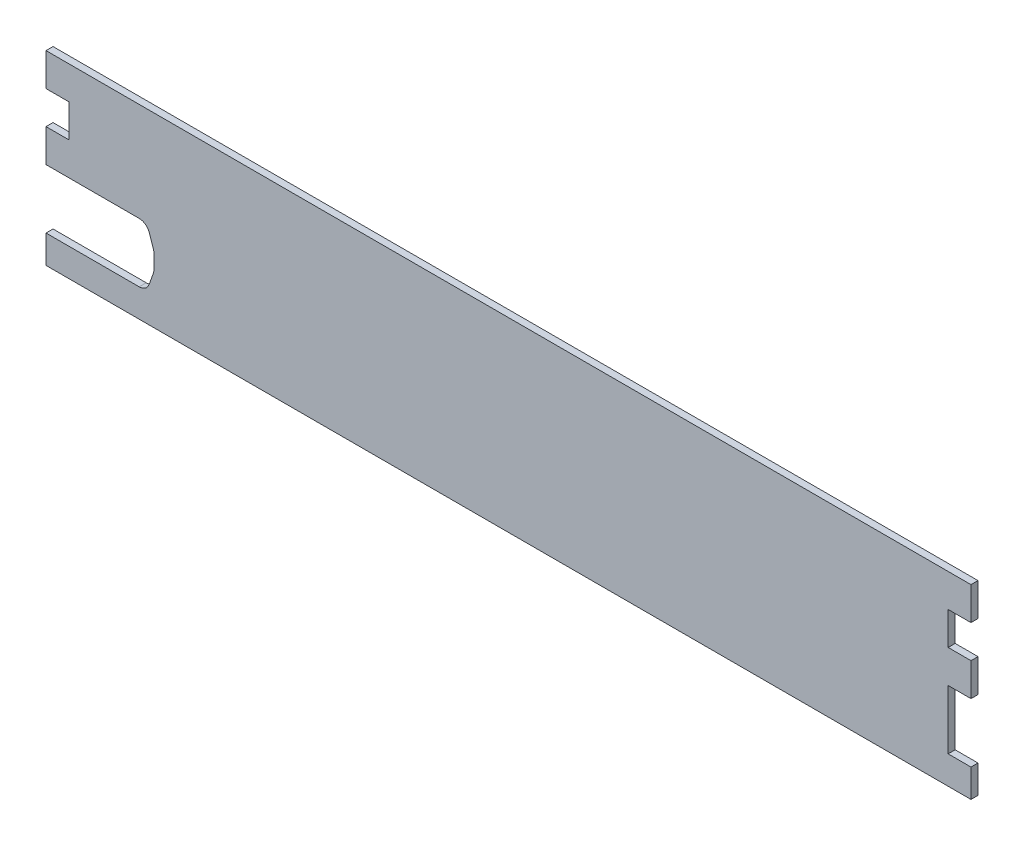
ISO-10303-21;
HEADER;
FILE_DESCRIPTION(('STEP AP214'),'2;1');
FILE_NAME('part.step','',(''),(''),'','','');
FILE_SCHEMA(('AUTOMOTIVE_DESIGN { 1 0 10303 214 1 1 1 1 }'));
ENDSEC;
DATA;
#1=APPLICATION_CONTEXT('core data for automotive mechanical design processes');
#2=APPLICATION_PROTOCOL_DEFINITION('international standard','automotive_design',2000,#1);
#3=PRODUCT_CONTEXT('',#1,'mechanical');
#4=PRODUCT('Part','Part','',(#3));
#5=PRODUCT_RELATED_PRODUCT_CATEGORY('part','',(#4));
#6=PRODUCT_DEFINITION_FORMATION('','',#4);
#7=PRODUCT_DEFINITION_CONTEXT('part definition',#1,'design');
#8=PRODUCT_DEFINITION('design','',#6,#7);
#9=PRODUCT_DEFINITION_SHAPE('','',#8);
#10=(LENGTH_UNIT() NAMED_UNIT(*) SI_UNIT(.MILLI.,.METRE.));
#11=(NAMED_UNIT(*) PLANE_ANGLE_UNIT() SI_UNIT($,.RADIAN.));
#12=(NAMED_UNIT(*) SI_UNIT($,.STERADIAN.) SOLID_ANGLE_UNIT());
#13=UNCERTAINTY_MEASURE_WITH_UNIT(LENGTH_MEASURE(1.E-05),#10,'distance_accuracy_value','');
#14=(GEOMETRIC_REPRESENTATION_CONTEXT(3) GLOBAL_UNCERTAINTY_ASSIGNED_CONTEXT((#13)) GLOBAL_UNIT_ASSIGNED_CONTEXT((#10,
#11,#12)) REPRESENTATION_CONTEXT('',''));
#15=CARTESIAN_POINT('',(0.,0.,0.));
#16=DIRECTION('',(0.,0.,1.));
#17=DIRECTION('',(1.,0.,0.));
#18=AXIS2_PLACEMENT_3D('',#15,#16,#17);
#19=CARTESIAN_POINT('',(-617.248326024445,-67.185778963985,-2.));
#20=DIRECTION('',(-8.04911692853256E-13,1.,0.));
#21=DIRECTION('',(-1.,-8.04911692853256E-13,0.));
#22=AXIS2_PLACEMENT_3D('',#19,#20,#21);
#23=PLANE('',#22);
#24=DIRECTION('',(-1.,-8.04911692853256E-13,0.));
#25=VECTOR('',#24,1.);
#26=CARTESIAN_POINT('',(-617.248326024445,-67.185778963985,0.));
#27=LINE('',#26,#25);
#28=CARTESIAN_POINT('',(-614.748326024445,-67.185778963983,0.));
#29=VERTEX_POINT('',#28);
#30=CARTESIAN_POINT('',(-621.248326024445,-67.185778963985,0.));
#31=VERTEX_POINT('',#30);
#32=EDGE_CURVE('E311',#29,#31,#27,.T.);
#33=ORIENTED_EDGE('',*,*,#32,.F.);
#34=DIRECTION('',(0.,0.,1.));
#35=VECTOR('',#34,1.);
#36=CARTESIAN_POINT('',(-614.748326024445,-67.185778963983,-2.));
#37=LINE('',#36,#35);
#38=CARTESIAN_POINT('',(-614.748326024445,-67.185778963983,-2.));
#39=VERTEX_POINT('',#38);
#40=EDGE_CURVE('E11',#39,#29,#37,.T.);
#41=ORIENTED_EDGE('',*,*,#40,.F.);
#42=DIRECTION('',(-1.,0.,0.));
#43=VECTOR('',#42,1.);
#44=CARTESIAN_POINT('',(-617.248326024445,-67.185778963985,-2.));
#45=LINE('',#44,#43);
#46=CARTESIAN_POINT('',(-621.248326024445,-67.185778963985,-2.));
#47=VERTEX_POINT('',#46);
#48=EDGE_CURVE('E52',#39,#47,#45,.T.);
#49=ORIENTED_EDGE('',*,*,#48,.T.);
#50=DIRECTION('',(0.,0.,1.));
#51=VECTOR('',#50,1.);
#52=CARTESIAN_POINT('',(-621.248326024445,-67.185778963985,-2.));
#53=LINE('',#52,#51);
#54=EDGE_CURVE('E37',#47,#31,#53,.T.);
#55=ORIENTED_EDGE('',*,*,#54,.T.);
#56=EDGE_LOOP('',(#33,#41,#49,#55));
#57=FACE_BOUND('',#56,.T.);
#58=ADVANCED_FACE('F33',(#57),#23,.T.);
#59=CARTESIAN_POINT('',(-614.748326024445,-75.1857789638208,-2.));
#60=DIRECTION('',(1.,0.,0.));
#61=DIRECTION('',(0.,0.,-1.));
#62=AXIS2_PLACEMENT_3D('',#59,#60,#61);
#63=PLANE('',#62);
#64=DIRECTION('',(0.,1.,0.));
#65=VECTOR('',#64,1.);
#66=CARTESIAN_POINT('',(-614.748326024445,-75.1857789638208,0.));
#67=LINE('',#66,#65);
#68=CARTESIAN_POINT('',(-614.748326024445,-75.1857789638208,0.));
#69=VERTEX_POINT('',#68);
#70=EDGE_CURVE('E309',#69,#29,#67,.T.);
#71=ORIENTED_EDGE('',*,*,#70,.F.);
#72=DIRECTION('',(0.,0.,1.));
#73=VECTOR('',#72,1.);
#74=CARTESIAN_POINT('',(-614.748326024445,-75.1857789638208,-2.));
#75=LINE('',#74,#73);
#76=CARTESIAN_POINT('',(-614.748326024445,-75.1857789638208,-2.));
#77=VERTEX_POINT('',#76);
#78=EDGE_CURVE('E43',#77,#69,#75,.T.);
#79=ORIENTED_EDGE('',*,*,#78,.F.);
#80=DIRECTION('',(0.,1.,0.));
#81=VECTOR('',#80,1.);
#82=CARTESIAN_POINT('',(-614.748326024445,-75.1857789638208,-2.));
#83=LINE('',#82,#81);
#84=EDGE_CURVE('E229',#77,#39,#83,.T.);
#85=ORIENTED_EDGE('',*,*,#84,.T.);
#86=ORIENTED_EDGE('',*,*,#40,.T.);
#87=EDGE_LOOP('',(#71,#79,#85,#86));
#88=FACE_BOUND('',#87,.T.);
#89=ADVANCED_FACE('F367',(#88),#63,.T.);
#90=CARTESIAN_POINT('',(-617.248326024445,-75.1857789638208,-2.));
#91=DIRECTION('',(0.,-1.,0.));
#92=DIRECTION('',(0.,0.,-1.));
#93=AXIS2_PLACEMENT_3D('',#90,#91,#92);
#94=PLANE('',#93);
#95=DIRECTION('',(1.,0.,0.));
#96=VECTOR('',#95,1.);
#97=CARTESIAN_POINT('',(-617.248326024445,-75.1857789638208,0.));
#98=LINE('',#97,#96);
#99=CARTESIAN_POINT('',(-878.248326024445,-75.1857789638218,0.));
#100=VERTEX_POINT('',#99);
#101=EDGE_CURVE('E218',#100,#69,#98,.T.);
#102=ORIENTED_EDGE('',*,*,#101,.F.);
#103=DIRECTION('',(0.,0.,1.));
#104=VECTOR('',#103,1.);
#105=CARTESIAN_POINT('',(-878.248326024445,-75.1857789638218,-2.));
#106=LINE('',#105,#104);
#107=CARTESIAN_POINT('',(-878.248326024445,-75.1857789638218,-2.));
#108=VERTEX_POINT('',#107);
#109=EDGE_CURVE('E213',#108,#100,#106,.T.);
#110=ORIENTED_EDGE('',*,*,#109,.F.);
#111=DIRECTION('',(1.,0.,0.));
#112=VECTOR('',#111,1.);
#113=CARTESIAN_POINT('',(-875.748326024445,-75.1857789638218,-2.));
#114=LINE('',#113,#112);
#115=EDGE_CURVE('E216',#108,#77,#114,.T.);
#116=ORIENTED_EDGE('',*,*,#115,.T.);
#117=ORIENTED_EDGE('',*,*,#78,.T.);
#118=EDGE_LOOP('',(#102,#110,#116,#117));
#119=FACE_BOUND('',#118,.T.);
#120=ADVANCED_FACE('F215',(#119),#94,.T.);
#121=CARTESIAN_POINT('',(-878.248326024445,-75.1857789638218,-2.));
#122=DIRECTION('',(-1.,0.,0.));
#123=DIRECTION('',(0.,0.,1.));
#124=AXIS2_PLACEMENT_3D('',#121,#122,#123);
#125=PLANE('',#124);
#126=DIRECTION('',(0.,-1.,0.));
#127=VECTOR('',#126,1.);
#128=CARTESIAN_POINT('',(-878.248326024445,-75.1857789638218,0.));
#129=LINE('',#128,#127);
#130=CARTESIAN_POINT('',(-878.248326024445,-67.185778963983,0.));
#131=VERTEX_POINT('',#130);
#132=EDGE_CURVE('E306',#131,#100,#129,.T.);
#133=ORIENTED_EDGE('',*,*,#132,.F.);
#134=DIRECTION('',(0.,0.,1.));
#135=VECTOR('',#134,1.);
#136=CARTESIAN_POINT('',(-878.248326024445,-67.185778963983,-2.));
#137=LINE('',#136,#135);
#138=CARTESIAN_POINT('',(-878.248326024445,-67.185778963983,-2.));
#139=VERTEX_POINT('',#138);
#140=EDGE_CURVE('E223',#139,#131,#137,.T.);
#141=ORIENTED_EDGE('',*,*,#140,.F.);
#142=DIRECTION('',(0.,-1.,0.));
#143=VECTOR('',#142,1.);
#144=CARTESIAN_POINT('',(-878.248326024445,-75.1857789638218,-2.));
#145=LINE('',#144,#143);
#146=EDGE_CURVE('E228',#139,#108,#145,.T.);
#147=ORIENTED_EDGE('',*,*,#146,.T.);
#148=ORIENTED_EDGE('',*,*,#109,.T.);
#149=EDGE_LOOP('',(#133,#141,#147,#148));
#150=FACE_BOUND('',#149,.T.);
#151=ADVANCED_FACE('F232',(#150),#125,.T.);
#152=CARTESIAN_POINT('',(-875.748326024445,-67.185778963983,-2.));
#153=DIRECTION('',(0.,1.,0.));
#154=DIRECTION('',(0.,0.,1.));
#155=AXIS2_PLACEMENT_3D('',#152,#153,#154);
#156=PLANE('',#155);
#157=DIRECTION('',(-1.,0.,0.));
#158=VECTOR('',#157,1.);
#159=CARTESIAN_POINT('',(-875.748326024445,-67.185778963983,0.));
#160=LINE('',#159,#158);
#161=CARTESIAN_POINT('',(-851.698326024445,-67.1857789639835,0.));
#162=VERTEX_POINT('',#161);
#163=EDGE_CURVE('E303',#162,#131,#160,.T.);
#164=ORIENTED_EDGE('',*,*,#163,.F.);
#165=DIRECTION('',(0.,0.,1.));
#166=VECTOR('',#165,1.);
#167=CARTESIAN_POINT('',(-851.698326024445,-67.1857789639835,-2.));
#168=LINE('',#167,#166);
#169=CARTESIAN_POINT('',(-851.698326024445,-67.1857789639835,-2.));
#170=VERTEX_POINT('',#169);
#171=EDGE_CURVE('E315',#170,#162,#168,.T.);
#172=ORIENTED_EDGE('',*,*,#171,.F.);
#173=DIRECTION('',(-1.,0.,0.));
#174=VECTOR('',#173,1.);
#175=CARTESIAN_POINT('',(-851.698326024445,-67.1857789639835,-2.));
#176=LINE('',#175,#174);
#177=EDGE_CURVE('E233',#170,#139,#176,.T.);
#178=ORIENTED_EDGE('',*,*,#177,.T.);
#179=ORIENTED_EDGE('',*,*,#140,.T.);
#180=EDGE_LOOP('',(#164,#172,#178,#179));
#181=FACE_BOUND('',#180,.T.);
#182=ADVANCED_FACE('F380',(#181),#156,.T.);
#183=CARTESIAN_POINT('',(-851.698326024445,-64.185778963983,-2.));
#184=DIRECTION('',(0.,0.,1.));
#185=DIRECTION('',(1.,0.,0.));
#186=AXIS2_PLACEMENT_3D('',#183,#184,#185);
#187=CYLINDRICAL_SURFACE('',#186,3.00000000000059);
#188=CARTESIAN_POINT('',(-851.698326024445,-64.185778963983,0.));
#189=DIRECTION('',(0.,0.,-1.));
#190=DIRECTION('',(1.,0.,0.));
#191=AXIS2_PLACEMENT_3D('',#188,#189,#190);
#192=CIRCLE('',#191,3.00000000000059);
#193=CARTESIAN_POINT('',(-848.873290675921,-65.1953210778113,0.));
#194=VERTEX_POINT('',#193);
#195=EDGE_CURVE('E300',#194,#162,#192,.T.);
#196=ORIENTED_EDGE('',*,*,#195,.F.);
#197=DIRECTION('',(0.,0.,1.));
#198=VECTOR('',#197,1.);
#199=CARTESIAN_POINT('',(-848.873290675921,-65.1953210778113,-2.));
#200=LINE('',#199,#198);
#201=CARTESIAN_POINT('',(-848.873290675921,-65.1953210778113,-2.));
#202=VERTEX_POINT('',#201);
#203=EDGE_CURVE('E318',#202,#194,#200,.T.);
#204=ORIENTED_EDGE('',*,*,#203,.F.);
#205=CARTESIAN_POINT('',(-851.698326024445,-64.185778963983,-2.));
#206=DIRECTION('',(0.,0.,-1.));
#207=DIRECTION('',(1.,0.,0.));
#208=AXIS2_PLACEMENT_3D('',#205,#206,#207);
#209=CIRCLE('',#208,3.00000000000059);
#210=EDGE_CURVE('E235',#202,#170,#209,.T.);
#211=ORIENTED_EDGE('',*,*,#210,.T.);
#212=ORIENTED_EDGE('',*,*,#171,.T.);
#213=EDGE_LOOP('',(#196,#204,#211,#212));
#214=FACE_BOUND('',#213,.T.);
#215=ADVANCED_FACE('F383',(#214),#187,.F.);
#216=CARTESIAN_POINT('',(-847.673290675921,-61.8373210778111,-2.));
#217=DIRECTION('',(-0.941678449508098,0.336514037941991,0.));
#218=DIRECTION('',(-0.336514037941991,-0.941678449508099,0.));
#219=AXIS2_PLACEMENT_3D('',#216,#217,#218);
#220=PLANE('',#219);
#221=DIRECTION('',(-0.336514037941991,-0.941678449508098,0.));
#222=VECTOR('',#221,1.);
#223=CARTESIAN_POINT('',(-847.673290675921,-61.8373210778111,0.));
#224=LINE('',#223,#222);
#225=CARTESIAN_POINT('',(-847.673290675921,-61.8373210778111,0.));
#226=VERTEX_POINT('',#225);
#227=EDGE_CURVE('E297',#226,#194,#224,.T.);
#228=ORIENTED_EDGE('',*,*,#227,.F.);
#229=DIRECTION('',(0.,0.,1.));
#230=VECTOR('',#229,1.);
#231=CARTESIAN_POINT('',(-847.673290675921,-61.8373210778111,-2.));
#232=LINE('',#231,#230);
#233=CARTESIAN_POINT('',(-847.673290675921,-61.8373210778111,-2.));
#234=VERTEX_POINT('',#233);
#235=EDGE_CURVE('E320',#234,#226,#232,.T.);
#236=ORIENTED_EDGE('',*,*,#235,.F.);
#237=DIRECTION('',(-0.336514037941991,-0.941678449508098,0.));
#238=VECTOR('',#237,1.);
#239=CARTESIAN_POINT('',(-847.673290675921,-61.8373210778111,-2.));
#240=LINE('',#239,#238);
#241=EDGE_CURVE('E522',#234,#202,#240,.T.);
#242=ORIENTED_EDGE('',*,*,#241,.T.);
#243=ORIENTED_EDGE('',*,*,#203,.T.);
#244=EDGE_LOOP('',(#228,#236,#242,#243));
#245=FACE_BOUND('',#244,.T.);
#246=ADVANCED_FACE('F387',(#245),#220,.T.);
#247=CARTESIAN_POINT('',(-850.498326024445,-60.827778963983,-2.));
#248=DIRECTION('',(0.,0.,1.));
#249=DIRECTION('',(1.,0.,0.));
#250=AXIS2_PLACEMENT_3D('',#247,#248,#249);
#251=CYLINDRICAL_SURFACE('',#250,3.00000000000021);
#252=CARTESIAN_POINT('',(-850.498326024445,-60.827778963983,0.));
#253=DIRECTION('',(0.,0.,-1.));
#254=DIRECTION('',(1.,0.,0.));
#255=AXIS2_PLACEMENT_3D('',#252,#253,#254);
#256=CIRCLE('',#255,3.00000000000021);
#257=CARTESIAN_POINT('',(-847.498326024445,-60.827778963983,0.));
#258=VERTEX_POINT('',#257);
#259=EDGE_CURVE('E294',#258,#226,#256,.T.);
#260=ORIENTED_EDGE('',*,*,#259,.F.);
#261=DIRECTION('',(0.,0.,1.));
#262=VECTOR('',#261,1.);
#263=CARTESIAN_POINT('',(-847.498326024445,-60.827778963983,-2.));
#264=LINE('',#263,#262);
#265=CARTESIAN_POINT('',(-847.498326024445,-60.827778963983,-2.));
#266=VERTEX_POINT('',#265);
#267=EDGE_CURVE('E322',#266,#258,#264,.T.);
#268=ORIENTED_EDGE('',*,*,#267,.F.);
#269=CARTESIAN_POINT('',(-850.498326024445,-60.827778963983,-2.));
#270=DIRECTION('',(0.,0.,-1.));
#271=DIRECTION('',(1.,0.,0.));
#272=AXIS2_PLACEMENT_3D('',#269,#270,#271);
#273=CIRCLE('',#272,3.00000000000021);
#274=EDGE_CURVE('E519',#266,#234,#273,.T.);
#275=ORIENTED_EDGE('',*,*,#274,.T.);
#276=ORIENTED_EDGE('',*,*,#235,.T.);
#277=EDGE_LOOP('',(#260,#268,#275,#276));
#278=FACE_BOUND('',#277,.T.);
#279=ADVANCED_FACE('F391',(#278),#251,.F.);
#280=CARTESIAN_POINT('',(-847.498326024445,-56.827778963983,-2.));
#281=DIRECTION('',(-1.,-1.38777878078144E-13,0.));
#282=DIRECTION('',(1.38777878078144E-13,-1.,0.));
#283=AXIS2_PLACEMENT_3D('',#280,#281,#282);
#284=PLANE('',#283);
#285=DIRECTION('',(1.38777878078144E-13,-1.,0.));
#286=VECTOR('',#285,1.);
#287=CARTESIAN_POINT('',(-847.498326024445,-56.827778963983,0.));
#288=LINE('',#287,#286);
#289=CARTESIAN_POINT('',(-847.498326024445,-56.827778963983,0.));
#290=VERTEX_POINT('',#289);
#291=EDGE_CURVE('E291',#290,#258,#288,.T.);
#292=ORIENTED_EDGE('',*,*,#291,.F.);
#293=DIRECTION('',(0.,0.,1.));
#294=VECTOR('',#293,1.);
#295=CARTESIAN_POINT('',(-847.498326024445,-56.827778963983,-2.));
#296=LINE('',#295,#294);
#297=CARTESIAN_POINT('',(-847.498326024445,-56.827778963983,-2.));
#298=VERTEX_POINT('',#297);
#299=EDGE_CURVE('E324',#298,#290,#296,.T.);
#300=ORIENTED_EDGE('',*,*,#299,.F.);
#301=DIRECTION('',(1.38777878078144E-13,-1.,0.));
#302=VECTOR('',#301,1.);
#303=CARTESIAN_POINT('',(-847.498326024445,-56.827778963983,-2.));
#304=LINE('',#303,#302);
#305=EDGE_CURVE('E516',#298,#266,#304,.T.);
#306=ORIENTED_EDGE('',*,*,#305,.T.);
#307=ORIENTED_EDGE('',*,*,#267,.T.);
#308=EDGE_LOOP('',(#292,#300,#306,#307));
#309=FACE_BOUND('',#308,.T.);
#310=ADVANCED_FACE('F395',(#309),#284,.T.);
#311=CARTESIAN_POINT('',(-850.498326024445,-56.827778963983,-2.));
#312=DIRECTION('',(0.,0.,1.));
#313=DIRECTION('',(1.,0.,0.));
#314=AXIS2_PLACEMENT_3D('',#311,#312,#313);
#315=CYLINDRICAL_SURFACE('',#314,2.99999999999946);
#316=CARTESIAN_POINT('',(-850.498326024445,-56.827778963983,0.));
#317=DIRECTION('',(0.,0.,-1.));
#318=DIRECTION('',(1.,0.,0.));
#319=AXIS2_PLACEMENT_3D('',#316,#317,#318);
#320=CIRCLE('',#319,2.99999999999946);
#321=CARTESIAN_POINT('',(-847.659216216776,-55.8585238376117,0.));
#322=VERTEX_POINT('',#321);
#323=EDGE_CURVE('E288',#322,#290,#320,.T.);
#324=ORIENTED_EDGE('',*,*,#323,.F.);
#325=DIRECTION('',(0.,0.,1.));
#326=VECTOR('',#325,1.);
#327=CARTESIAN_POINT('',(-847.659216216776,-55.8585238376117,-2.));
#328=LINE('',#327,#326);
#329=CARTESIAN_POINT('',(-847.659216216776,-55.8585238376117,-2.));
#330=VERTEX_POINT('',#329);
#331=EDGE_CURVE('E326',#330,#322,#328,.T.);
#332=ORIENTED_EDGE('',*,*,#331,.F.);
#333=CARTESIAN_POINT('',(-850.498326024445,-56.827778963983,-2.));
#334=DIRECTION('',(0.,0.,-1.));
#335=DIRECTION('',(1.,0.,0.));
#336=AXIS2_PLACEMENT_3D('',#333,#334,#335);
#337=CIRCLE('',#336,2.99999999999946);
#338=EDGE_CURVE('E513',#330,#298,#337,.T.);
#339=ORIENTED_EDGE('',*,*,#338,.T.);
#340=ORIENTED_EDGE('',*,*,#299,.T.);
#341=EDGE_LOOP('',(#324,#332,#339,#340));
#342=FACE_BOUND('',#341,.T.);
#343=ADVANCED_FACE('F399',(#342),#315,.F.);
#344=CARTESIAN_POINT('',(-848.859216216776,-52.3435238376116,-2.));
#345=DIRECTION('',(-0.946369935889529,-0.32308504212428,0.));
#346=DIRECTION('',(0.32308504212428,-0.946369935889529,0.));
#347=AXIS2_PLACEMENT_3D('',#344,#345,#346);
#348=PLANE('',#347);
#349=DIRECTION('',(0.32308504212428,-0.946369935889529,0.));
#350=VECTOR('',#349,1.);
#351=CARTESIAN_POINT('',(-848.859216216776,-52.3435238376116,0.));
#352=LINE('',#351,#350);
#353=CARTESIAN_POINT('',(-848.859216216776,-52.3435238376116,0.));
#354=VERTEX_POINT('',#353);
#355=EDGE_CURVE('E285',#354,#322,#352,.T.);
#356=ORIENTED_EDGE('',*,*,#355,.F.);
#357=DIRECTION('',(0.,0.,1.));
#358=VECTOR('',#357,1.);
#359=CARTESIAN_POINT('',(-848.859216216776,-52.3435238376116,-2.));
#360=LINE('',#359,#358);
#361=CARTESIAN_POINT('',(-848.859216216776,-52.3435238376116,-2.));
#362=VERTEX_POINT('',#361);
#363=EDGE_CURVE('E328',#362,#354,#360,.T.);
#364=ORIENTED_EDGE('',*,*,#363,.F.);
#365=DIRECTION('',(0.32308504212428,-0.946369935889529,0.));
#366=VECTOR('',#365,1.);
#367=CARTESIAN_POINT('',(-848.859216216776,-52.3435238376116,-2.));
#368=LINE('',#367,#366);
#369=EDGE_CURVE('E510',#362,#330,#368,.T.);
#370=ORIENTED_EDGE('',*,*,#369,.T.);
#371=ORIENTED_EDGE('',*,*,#331,.T.);
#372=EDGE_LOOP('',(#356,#364,#370,#371));
#373=FACE_BOUND('',#372,.T.);
#374=ADVANCED_FACE('F403',(#373),#348,.T.);
#375=CARTESIAN_POINT('',(-851.698326024445,-53.312778963983,-2.));
#376=DIRECTION('',(0.,0.,1.));
#377=DIRECTION('',(1.,0.,0.));
#378=AXIS2_PLACEMENT_3D('',#375,#376,#377);
#379=CYLINDRICAL_SURFACE('',#378,2.99999999999992);
#380=CARTESIAN_POINT('',(-851.698326024445,-53.312778963983,0.));
#381=DIRECTION('',(0.,0.,-1.));
#382=DIRECTION('',(1.,0.,0.));
#383=AXIS2_PLACEMENT_3D('',#380,#381,#382);
#384=CIRCLE('',#383,2.99999999999992);
#385=CARTESIAN_POINT('',(-851.698326024445,-50.3127789639831,0.));
#386=VERTEX_POINT('',#385);
#387=EDGE_CURVE('E282',#386,#354,#384,.T.);
#388=ORIENTED_EDGE('',*,*,#387,.F.);
#389=DIRECTION('',(0.,0.,1.));
#390=VECTOR('',#389,1.);
#391=CARTESIAN_POINT('',(-851.698326024445,-50.3127789639831,-2.));
#392=LINE('',#391,#390);
#393=CARTESIAN_POINT('',(-851.698326024445,-50.3127789639831,-2.));
#394=VERTEX_POINT('',#393);
#395=EDGE_CURVE('E330',#394,#386,#392,.T.);
#396=ORIENTED_EDGE('',*,*,#395,.F.);
#397=CARTESIAN_POINT('',(-851.698326024445,-53.312778963983,-2.));
#398=DIRECTION('',(0.,0.,-1.));
#399=DIRECTION('',(1.,0.,0.));
#400=AXIS2_PLACEMENT_3D('',#397,#398,#399);
#401=CIRCLE('',#400,2.99999999999992);
#402=EDGE_CURVE('E507',#394,#362,#401,.T.);
#403=ORIENTED_EDGE('',*,*,#402,.T.);
#404=ORIENTED_EDGE('',*,*,#363,.T.);
#405=EDGE_LOOP('',(#388,#396,#403,#404));
#406=FACE_BOUND('',#405,.T.);
#407=ADVANCED_FACE('F407',(#406),#379,.F.);
#408=CARTESIAN_POINT('',(-875.748326024445,-50.312778963983,-2.));
#409=DIRECTION('',(0.,-1.,0.));
#410=DIRECTION('',(1.,0.,0.));
#411=AXIS2_PLACEMENT_3D('',#408,#409,#410);
#412=PLANE('',#411);
#413=DIRECTION('',(1.,0.,0.));
#414=VECTOR('',#413,1.);
#415=CARTESIAN_POINT('',(-875.748326024445,-50.312778963983,0.));
#416=LINE('',#415,#414);
#417=CARTESIAN_POINT('',(-878.248326024445,-50.312778963983,0.));
#418=VERTEX_POINT('',#417);
#419=EDGE_CURVE('E279',#418,#386,#416,.T.);
#420=ORIENTED_EDGE('',*,*,#419,.F.);
#421=DIRECTION('',(0.,0.,1.));
#422=VECTOR('',#421,1.);
#423=CARTESIAN_POINT('',(-878.248326024445,-50.312778963983,-2.));
#424=LINE('',#423,#422);
#425=CARTESIAN_POINT('',(-878.248326024445,-50.312778963983,-2.));
#426=VERTEX_POINT('',#425);
#427=EDGE_CURVE('E332',#426,#418,#424,.T.);
#428=ORIENTED_EDGE('',*,*,#427,.F.);
#429=DIRECTION('',(1.,0.,0.));
#430=VECTOR('',#429,1.);
#431=CARTESIAN_POINT('',(-875.748326024445,-50.312778963983,-2.));
#432=LINE('',#431,#430);
#433=EDGE_CURVE('E505',#426,#394,#432,.T.);
#434=ORIENTED_EDGE('',*,*,#433,.T.);
#435=ORIENTED_EDGE('',*,*,#395,.T.);
#436=EDGE_LOOP('',(#420,#428,#434,#435));
#437=FACE_BOUND('',#436,.T.);
#438=ADVANCED_FACE('F411',(#437),#412,.T.);
#439=CARTESIAN_POINT('',(-878.248326024445,-50.312778963983,-2.));
#440=DIRECTION('',(-1.,0.,0.));
#441=DIRECTION('',(0.,0.,1.));
#442=AXIS2_PLACEMENT_3D('',#439,#440,#441);
#443=PLANE('',#442);
#444=DIRECTION('',(0.,-1.,0.));
#445=VECTOR('',#444,1.);
#446=CARTESIAN_POINT('',(-878.248326024445,-50.312778963983,0.));
#447=LINE('',#446,#445);
#448=CARTESIAN_POINT('',(-878.248326024445,-40.9356516944667,0.));
#449=VERTEX_POINT('',#448);
#450=EDGE_CURVE('E276',#449,#418,#447,.T.);
#451=ORIENTED_EDGE('',*,*,#450,.F.);
#452=DIRECTION('',(0.,0.,1.));
#453=VECTOR('',#452,1.);
#454=CARTESIAN_POINT('',(-878.248326024445,-40.9356516944667,-2.));
#455=LINE('',#454,#453);
#456=CARTESIAN_POINT('',(-878.248326024445,-40.9356516944667,-2.));
#457=VERTEX_POINT('',#456);
#458=EDGE_CURVE('E335',#457,#449,#455,.T.);
#459=ORIENTED_EDGE('',*,*,#458,.F.);
#460=DIRECTION('',(0.,-1.,0.));
#461=VECTOR('',#460,1.);
#462=CARTESIAN_POINT('',(-878.248326024445,-50.312778963983,-2.));
#463=LINE('',#462,#461);
#464=EDGE_CURVE('E502',#457,#426,#463,.T.);
#465=ORIENTED_EDGE('',*,*,#464,.T.);
#466=ORIENTED_EDGE('',*,*,#427,.T.);
#467=EDGE_LOOP('',(#451,#459,#465,#466));
#468=FACE_BOUND('',#467,.T.);
#469=ADVANCED_FACE('F415',(#468),#443,.T.);
#470=CARTESIAN_POINT('',(-875.748326024445,-40.9356516944667,-2.));
#471=DIRECTION('',(0.,1.,0.));
#472=DIRECTION('',(-1.,0.,0.));
#473=AXIS2_PLACEMENT_3D('',#470,#471,#472);
#474=PLANE('',#473);
#475=DIRECTION('',(-1.,0.,0.));
#476=VECTOR('',#475,1.);
#477=CARTESIAN_POINT('',(-875.748326024445,-40.9356516944667,0.));
#478=LINE('',#477,#476);
#479=CARTESIAN_POINT('',(-871.748326024445,-40.9356516944667,0.));
#480=VERTEX_POINT('',#479);
#481=EDGE_CURVE('E273',#480,#449,#478,.T.);
#482=ORIENTED_EDGE('',*,*,#481,.F.);
#483=DIRECTION('',(0.,0.,1.));
#484=VECTOR('',#483,1.);
#485=CARTESIAN_POINT('',(-871.748326024445,-40.9356516944667,-2.));
#486=LINE('',#485,#484);
#487=CARTESIAN_POINT('',(-871.748326024445,-40.9356516944667,-2.));
#488=VERTEX_POINT('',#487);
#489=EDGE_CURVE('E337',#488,#480,#486,.T.);
#490=ORIENTED_EDGE('',*,*,#489,.F.);
#491=DIRECTION('',(-1.,0.,0.));
#492=VECTOR('',#491,1.);
#493=CARTESIAN_POINT('',(-871.748326024445,-40.9356516944667,-2.));
#494=LINE('',#493,#492);
#495=EDGE_CURVE('E500',#488,#457,#494,.T.);
#496=ORIENTED_EDGE('',*,*,#495,.T.);
#497=ORIENTED_EDGE('',*,*,#458,.T.);
#498=EDGE_LOOP('',(#482,#490,#496,#497));
#499=FACE_BOUND('',#498,.T.);
#500=ADVANCED_FACE('F419',(#499),#474,.T.);
#501=CARTESIAN_POINT('',(-871.748326024445,-31.5585244249505,-2.));
#502=DIRECTION('',(-1.,0.,0.));
#503=DIRECTION('',(0.,0.,1.));
#504=AXIS2_PLACEMENT_3D('',#501,#502,#503);
#505=PLANE('',#504);
#506=DIRECTION('',(0.,-1.,0.));
#507=VECTOR('',#506,1.);
#508=CARTESIAN_POINT('',(-871.748326024445,-31.5585244249505,0.));
#509=LINE('',#508,#507);
#510=CARTESIAN_POINT('',(-871.748326024445,-31.5585244249505,0.));
#511=VERTEX_POINT('',#510);
#512=EDGE_CURVE('E270',#511,#480,#509,.T.);
#513=ORIENTED_EDGE('',*,*,#512,.F.);
#514=DIRECTION('',(0.,0.,1.));
#515=VECTOR('',#514,1.);
#516=CARTESIAN_POINT('',(-871.748326024445,-31.5585244249505,-2.));
#517=LINE('',#516,#515);
#518=CARTESIAN_POINT('',(-871.748326024445,-31.5585244249505,-2.));
#519=VERTEX_POINT('',#518);
#520=EDGE_CURVE('E340',#519,#511,#517,.T.);
#521=ORIENTED_EDGE('',*,*,#520,.F.);
#522=DIRECTION('',(0.,-1.,0.));
#523=VECTOR('',#522,1.);
#524=CARTESIAN_POINT('',(-871.748326024445,-31.5585244249505,-2.));
#525=LINE('',#524,#523);
#526=EDGE_CURVE('E497',#519,#488,#525,.T.);
#527=ORIENTED_EDGE('',*,*,#526,.T.);
#528=ORIENTED_EDGE('',*,*,#489,.T.);
#529=EDGE_LOOP('',(#513,#521,#527,#528));
#530=FACE_BOUND('',#529,.T.);
#531=ADVANCED_FACE('F423',(#530),#505,.T.);
#532=CARTESIAN_POINT('',(-875.748326024445,-31.5585244249505,-2.));
#533=DIRECTION('',(0.,-1.,0.));
#534=DIRECTION('',(0.,0.,-1.));
#535=AXIS2_PLACEMENT_3D('',#532,#533,#534);
#536=PLANE('',#535);
#537=DIRECTION('',(1.,0.,0.));
#538=VECTOR('',#537,1.);
#539=CARTESIAN_POINT('',(-875.748326024445,-31.5585244249505,0.));
#540=LINE('',#539,#538);
#541=CARTESIAN_POINT('',(-878.248326024445,-31.5585244249505,0.));
#542=VERTEX_POINT('',#541);
#543=EDGE_CURVE('E267',#542,#511,#540,.T.);
#544=ORIENTED_EDGE('',*,*,#543,.F.);
#545=DIRECTION('',(0.,0.,1.));
#546=VECTOR('',#545,1.);
#547=CARTESIAN_POINT('',(-878.248326024445,-31.5585244249505,-2.));
#548=LINE('',#547,#546);
#549=CARTESIAN_POINT('',(-878.248326024445,-31.5585244249505,-2.));
#550=VERTEX_POINT('',#549);
#551=EDGE_CURVE('E342',#550,#542,#548,.T.);
#552=ORIENTED_EDGE('',*,*,#551,.F.);
#553=DIRECTION('',(1.,0.,0.));
#554=VECTOR('',#553,1.);
#555=CARTESIAN_POINT('',(-875.748326024445,-31.5585244249505,-2.));
#556=LINE('',#555,#554);
#557=EDGE_CURVE('E495',#550,#519,#556,.T.);
#558=ORIENTED_EDGE('',*,*,#557,.T.);
#559=ORIENTED_EDGE('',*,*,#520,.T.);
#560=EDGE_LOOP('',(#544,#552,#558,#559));
#561=FACE_BOUND('',#560,.T.);
#562=ADVANCED_FACE('F427',(#561),#536,.T.);
#563=CARTESIAN_POINT('',(-878.248326024445,-31.5585244249505,-2.));
#564=DIRECTION('',(-1.,0.,0.));
#565=DIRECTION('',(0.,0.,1.));
#566=AXIS2_PLACEMENT_3D('',#563,#564,#565);
#567=PLANE('',#566);
#568=DIRECTION('',(0.,-1.,0.));
#569=VECTOR('',#568,1.);
#570=CARTESIAN_POINT('',(-878.248326024445,-31.5585244249505,0.));
#571=LINE('',#570,#569);
#572=CARTESIAN_POINT('',(-878.248326024445,-22.1813971554342,0.));
#573=VERTEX_POINT('',#572);
#574=EDGE_CURVE('E264',#573,#542,#571,.T.);
#575=ORIENTED_EDGE('',*,*,#574,.F.);
#576=DIRECTION('',(0.,0.,1.));
#577=VECTOR('',#576,1.);
#578=CARTESIAN_POINT('',(-878.248326024445,-22.1813971554342,-2.));
#579=LINE('',#578,#577);
#580=CARTESIAN_POINT('',(-878.248326024445,-22.1813971554342,-2.));
#581=VERTEX_POINT('',#580);
#582=EDGE_CURVE('E345',#581,#573,#579,.T.);
#583=ORIENTED_EDGE('',*,*,#582,.F.);
#584=DIRECTION('',(0.,-1.,0.));
#585=VECTOR('',#584,1.);
#586=CARTESIAN_POINT('',(-878.248326024445,-31.5585244249505,-2.));
#587=LINE('',#586,#585);
#588=EDGE_CURVE('E492',#581,#550,#587,.T.);
#589=ORIENTED_EDGE('',*,*,#588,.T.);
#590=ORIENTED_EDGE('',*,*,#551,.T.);
#591=EDGE_LOOP('',(#575,#583,#589,#590));
#592=FACE_BOUND('',#591,.T.);
#593=ADVANCED_FACE('F431',(#592),#567,.T.);
#594=CARTESIAN_POINT('',(-875.748326024445,-22.1813971554342,-2.));
#595=DIRECTION('',(0.,1.,0.));
#596=DIRECTION('',(-1.,0.,0.));
#597=AXIS2_PLACEMENT_3D('',#594,#595,#596);
#598=PLANE('',#597);
#599=DIRECTION('',(-1.,0.,0.));
#600=VECTOR('',#599,1.);
#601=CARTESIAN_POINT('',(-875.748326024445,-22.1813971554342,0.));
#602=LINE('',#601,#600);
#603=CARTESIAN_POINT('',(-614.748326024444,-22.1813971554342,0.));
#604=VERTEX_POINT('',#603);
#605=EDGE_CURVE('E261',#604,#573,#602,.T.);
#606=ORIENTED_EDGE('',*,*,#605,.F.);
#607=DIRECTION('',(0.,0.,1.));
#608=VECTOR('',#607,1.);
#609=CARTESIAN_POINT('',(-614.748326024444,-22.1813971554342,-2.));
#610=LINE('',#609,#608);
#611=CARTESIAN_POINT('',(-614.748326024444,-22.1813971554342,-2.));
#612=VERTEX_POINT('',#611);
#613=EDGE_CURVE('E347',#612,#604,#610,.T.);
#614=ORIENTED_EDGE('',*,*,#613,.F.);
#615=DIRECTION('',(-1.,0.,0.));
#616=VECTOR('',#615,1.);
#617=CARTESIAN_POINT('',(-617.248326024445,-22.1813971554342,-2.));
#618=LINE('',#617,#616);
#619=EDGE_CURVE('E486',#612,#581,#618,.T.);
#620=ORIENTED_EDGE('',*,*,#619,.T.);
#621=ORIENTED_EDGE('',*,*,#582,.T.);
#622=EDGE_LOOP('',(#606,#614,#620,#621));
#623=FACE_BOUND('',#622,.T.);
#624=ADVANCED_FACE('F435',(#623),#598,.T.);
#625=CARTESIAN_POINT('',(-614.748326024444,-31.5585244249505,-2.));
#626=DIRECTION('',(1.,0.,0.));
#627=DIRECTION('',(0.,0.,-1.));
#628=AXIS2_PLACEMENT_3D('',#625,#626,#627);
#629=PLANE('',#628);
#630=DIRECTION('',(0.,1.,0.));
#631=VECTOR('',#630,1.);
#632=CARTESIAN_POINT('',(-614.748326024444,-31.5585244249505,0.));
#633=LINE('',#632,#631);
#634=CARTESIAN_POINT('',(-614.748326024444,-31.5585244249505,0.));
#635=VERTEX_POINT('',#634);
#636=EDGE_CURVE('E258',#635,#604,#633,.T.);
#637=ORIENTED_EDGE('',*,*,#636,.F.);
#638=DIRECTION('',(0.,0.,1.));
#639=VECTOR('',#638,1.);
#640=CARTESIAN_POINT('',(-614.748326024444,-31.5585244249505,-2.));
#641=LINE('',#640,#639);
#642=CARTESIAN_POINT('',(-614.748326024444,-31.5585244249505,-2.));
#643=VERTEX_POINT('',#642);
#644=EDGE_CURVE('E350',#643,#635,#641,.T.);
#645=ORIENTED_EDGE('',*,*,#644,.F.);
#646=DIRECTION('',(0.,1.,0.));
#647=VECTOR('',#646,1.);
#648=CARTESIAN_POINT('',(-614.748326024444,-31.5585244249505,-2.));
#649=LINE('',#648,#647);
#650=EDGE_CURVE('E484',#643,#612,#649,.T.);
#651=ORIENTED_EDGE('',*,*,#650,.T.);
#652=ORIENTED_EDGE('',*,*,#613,.T.);
#653=EDGE_LOOP('',(#637,#645,#651,#652));
#654=FACE_BOUND('',#653,.T.);
#655=ADVANCED_FACE('F439',(#654),#629,.T.);
#656=CARTESIAN_POINT('',(-617.248326024445,-31.5585244249505,-2.));
#657=DIRECTION('',(0.,-1.,0.));
#658=DIRECTION('',(1.,0.,0.));
#659=AXIS2_PLACEMENT_3D('',#656,#657,#658);
#660=PLANE('',#659);
#661=DIRECTION('',(1.,0.,0.));
#662=VECTOR('',#661,1.);
#663=CARTESIAN_POINT('',(-617.248326024445,-31.5585244249505,0.));
#664=LINE('',#663,#662);
#665=CARTESIAN_POINT('',(-621.248326024445,-31.5585244249505,0.));
#666=VERTEX_POINT('',#665);
#667=EDGE_CURVE('E255',#666,#635,#664,.T.);
#668=ORIENTED_EDGE('',*,*,#667,.F.);
#669=DIRECTION('',(0.,0.,1.));
#670=VECTOR('',#669,1.);
#671=CARTESIAN_POINT('',(-621.248326024445,-31.5585244249505,-2.));
#672=LINE('',#671,#670);
#673=CARTESIAN_POINT('',(-621.248326024445,-31.5585244249505,-2.));
#674=VERTEX_POINT('',#673);
#675=EDGE_CURVE('E352',#674,#666,#672,.T.);
#676=ORIENTED_EDGE('',*,*,#675,.F.);
#677=DIRECTION('',(1.,0.,0.));
#678=VECTOR('',#677,1.);
#679=CARTESIAN_POINT('',(-621.248326024445,-31.5585244249505,-2.));
#680=LINE('',#679,#678);
#681=EDGE_CURVE('E479',#674,#643,#680,.T.);
#682=ORIENTED_EDGE('',*,*,#681,.T.);
#683=ORIENTED_EDGE('',*,*,#644,.T.);
#684=EDGE_LOOP('',(#668,#676,#682,#683));
#685=FACE_BOUND('',#684,.T.);
#686=ADVANCED_FACE('F443',(#685),#660,.T.);
#687=CARTESIAN_POINT('',(-621.248326024445,-40.9356516944667,-2.));
#688=DIRECTION('',(1.,0.,0.));
#689=DIRECTION('',(0.,0.,-1.));
#690=AXIS2_PLACEMENT_3D('',#687,#688,#689);
#691=PLANE('',#690);
#692=DIRECTION('',(0.,1.,0.));
#693=VECTOR('',#692,1.);
#694=CARTESIAN_POINT('',(-621.248326024445,-40.9356516944667,0.));
#695=LINE('',#694,#693);
#696=CARTESIAN_POINT('',(-621.248326024445,-40.9356516944667,0.));
#697=VERTEX_POINT('',#696);
#698=EDGE_CURVE('E252',#697,#666,#695,.T.);
#699=ORIENTED_EDGE('',*,*,#698,.F.);
#700=DIRECTION('',(0.,0.,1.));
#701=VECTOR('',#700,1.);
#702=CARTESIAN_POINT('',(-621.248326024445,-40.9356516944667,-2.));
#703=LINE('',#702,#701);
#704=CARTESIAN_POINT('',(-621.248326024445,-40.9356516944667,-2.));
#705=VERTEX_POINT('',#704);
#706=EDGE_CURVE('E355',#705,#697,#703,.T.);
#707=ORIENTED_EDGE('',*,*,#706,.F.);
#708=DIRECTION('',(0.,1.,0.));
#709=VECTOR('',#708,1.);
#710=CARTESIAN_POINT('',(-621.248326024445,-40.9356516944667,-2.));
#711=LINE('',#710,#709);
#712=EDGE_CURVE('E477',#705,#674,#711,.T.);
#713=ORIENTED_EDGE('',*,*,#712,.T.);
#714=ORIENTED_EDGE('',*,*,#675,.T.);
#715=EDGE_LOOP('',(#699,#707,#713,#714));
#716=FACE_BOUND('',#715,.T.);
#717=ADVANCED_FACE('F447',(#716),#691,.T.);
#718=CARTESIAN_POINT('',(-617.248326024445,-40.9356516944667,-2.));
#719=DIRECTION('',(0.,1.,0.));
#720=DIRECTION('',(0.,0.,1.));
#721=AXIS2_PLACEMENT_3D('',#718,#719,#720);
#722=PLANE('',#721);
#723=DIRECTION('',(-1.,0.,0.));
#724=VECTOR('',#723,1.);
#725=CARTESIAN_POINT('',(-617.248326024445,-40.9356516944667,0.));
#726=LINE('',#725,#724);
#727=CARTESIAN_POINT('',(-614.748326024445,-40.9356516944667,0.));
#728=VERTEX_POINT('',#727);
#729=EDGE_CURVE('E249',#728,#697,#726,.T.);
#730=ORIENTED_EDGE('',*,*,#729,.F.);
#731=DIRECTION('',(0.,0.,1.));
#732=VECTOR('',#731,1.);
#733=CARTESIAN_POINT('',(-614.748326024445,-40.9356516944667,-2.));
#734=LINE('',#733,#732);
#735=CARTESIAN_POINT('',(-614.748326024445,-40.9356516944667,-2.));
#736=VERTEX_POINT('',#735);
#737=EDGE_CURVE('E357',#736,#728,#734,.T.);
#738=ORIENTED_EDGE('',*,*,#737,.F.);
#739=DIRECTION('',(-1.,0.,0.));
#740=VECTOR('',#739,1.);
#741=CARTESIAN_POINT('',(-617.248326024445,-40.9356516944667,-2.));
#742=LINE('',#741,#740);
#743=EDGE_CURVE('E474',#736,#705,#742,.T.);
#744=ORIENTED_EDGE('',*,*,#743,.T.);
#745=ORIENTED_EDGE('',*,*,#706,.T.);
#746=EDGE_LOOP('',(#730,#738,#744,#745));
#747=FACE_BOUND('',#746,.T.);
#748=ADVANCED_FACE('F451',(#747),#722,.T.);
#749=CARTESIAN_POINT('',(-614.748326024445,-40.9356516944667,-2.));
#750=DIRECTION('',(1.,0.,0.));
#751=DIRECTION('',(0.,1.,0.));
#752=AXIS2_PLACEMENT_3D('',#749,#750,#751);
#753=PLANE('',#752);
#754=DIRECTION('',(0.,1.,0.));
#755=VECTOR('',#754,1.);
#756=CARTESIAN_POINT('',(-614.748326024445,-40.9356516944667,0.));
#757=LINE('',#756,#755);
#758=CARTESIAN_POINT('',(-614.748326024445,-50.3127789639829,0.));
#759=VERTEX_POINT('',#758);
#760=EDGE_CURVE('E246',#759,#728,#757,.T.);
#761=ORIENTED_EDGE('',*,*,#760,.F.);
#762=DIRECTION('',(0.,0.,1.));
#763=VECTOR('',#762,1.);
#764=CARTESIAN_POINT('',(-614.748326024445,-50.3127789639829,-2.));
#765=LINE('',#764,#763);
#766=CARTESIAN_POINT('',(-614.748326024445,-50.3127789639829,-2.));
#767=VERTEX_POINT('',#766);
#768=EDGE_CURVE('E360',#767,#759,#765,.T.);
#769=ORIENTED_EDGE('',*,*,#768,.F.);
#770=DIRECTION('',(0.,1.,0.));
#771=VECTOR('',#770,1.);
#772=CARTESIAN_POINT('',(-614.748326024445,-40.9356516944667,-2.));
#773=LINE('',#772,#771);
#774=EDGE_CURVE('E554',#767,#736,#773,.T.);
#775=ORIENTED_EDGE('',*,*,#774,.T.);
#776=ORIENTED_EDGE('',*,*,#737,.T.);
#777=EDGE_LOOP('',(#761,#769,#775,#776));
#778=FACE_BOUND('',#777,.T.);
#779=ADVANCED_FACE('F455',(#778),#753,.T.);
#780=CARTESIAN_POINT('',(-614.748326024445,-50.3127789639829,-2.));
#781=DIRECTION('',(-9.3087930526267E-13,-1.,0.));
#782=DIRECTION('',(1.,-9.3087930526267E-13,0.));
#783=AXIS2_PLACEMENT_3D('',#780,#781,#782);
#784=PLANE('',#783);
#785=DIRECTION('',(1.,-9.3087930526267E-13,0.));
#786=VECTOR('',#785,1.);
#787=CARTESIAN_POINT('',(-614.748326024445,-50.3127789639829,0.));
#788=LINE('',#787,#786);
#789=CARTESIAN_POINT('',(-621.248326024444,-50.3127789639769,0.));
#790=VERTEX_POINT('',#789);
#791=EDGE_CURVE('E243',#790,#759,#788,.T.);
#792=ORIENTED_EDGE('',*,*,#791,.F.);
#793=DIRECTION('',(0.,0.,1.));
#794=VECTOR('',#793,1.);
#795=CARTESIAN_POINT('',(-621.248326024444,-50.3127789639769,-2.));
#796=LINE('',#795,#794);
#797=CARTESIAN_POINT('',(-621.248326024444,-50.3127789639769,-2.));
#798=VERTEX_POINT('',#797);
#799=EDGE_CURVE('E361',#798,#790,#796,.T.);
#800=ORIENTED_EDGE('',*,*,#799,.F.);
#801=DIRECTION('',(1.,-9.3087930526267E-13,0.));
#802=VECTOR('',#801,1.);
#803=CARTESIAN_POINT('',(-614.748326024445,-50.3127789639829,-2.));
#804=LINE('',#803,#802);
#805=EDGE_CURVE('E468',#798,#767,#804,.T.);
#806=ORIENTED_EDGE('',*,*,#805,.T.);
#807=ORIENTED_EDGE('',*,*,#768,.T.);
#808=EDGE_LOOP('',(#792,#800,#806,#807));
#809=FACE_BOUND('',#808,.T.);
#810=ADVANCED_FACE('F458',(#809),#784,.T.);
#811=CARTESIAN_POINT('',(-621.248326024444,-50.3127789639769,-2.));
#812=DIRECTION('',(1.,0.,0.));
#813=DIRECTION('',(0.,1.,0.));
#814=AXIS2_PLACEMENT_3D('',#811,#812,#813);
#815=PLANE('',#814);
#816=DIRECTION('',(0.,1.,0.));
#817=VECTOR('',#816,1.);
#818=CARTESIAN_POINT('',(-621.248326024444,-50.3127789639769,0.));
#819=LINE('',#818,#817);
#820=EDGE_CURVE('E240',#31,#790,#819,.T.);
#821=ORIENTED_EDGE('',*,*,#820,.F.);
#822=ORIENTED_EDGE('',*,*,#54,.F.);
#823=DIRECTION('',(0.,1.,0.));
#824=VECTOR('',#823,1.);
#825=CARTESIAN_POINT('',(-621.248326024444,-50.3127789639769,-2.));
#826=LINE('',#825,#824);
#827=EDGE_CURVE('E557',#47,#798,#826,.T.);
#828=ORIENTED_EDGE('',*,*,#827,.T.);
#829=ORIENTED_EDGE('',*,*,#799,.T.);
#830=EDGE_LOOP('',(#821,#822,#828,#829));
#831=FACE_BOUND('',#830,.T.);
#832=ADVANCED_FACE('F35',(#831),#815,.T.);
#833=CARTESIAN_POINT('',(-851.698326024445,-53.312778963983,-2.));
#834=DIRECTION('',(0.,0.,1.));
#835=DIRECTION('',(1.,0.,0.));
#836=AXIS2_PLACEMENT_3D('',#833,#834,#835);
#837=PLANE('',#836);
#838=ORIENTED_EDGE('',*,*,#48,.F.);
#839=ORIENTED_EDGE('',*,*,#84,.F.);
#840=ORIENTED_EDGE('',*,*,#115,.F.);
#841=ORIENTED_EDGE('',*,*,#146,.F.);
#842=ORIENTED_EDGE('',*,*,#177,.F.);
#843=ORIENTED_EDGE('',*,*,#210,.F.);
#844=ORIENTED_EDGE('',*,*,#241,.F.);
#845=ORIENTED_EDGE('',*,*,#274,.F.);
#846=ORIENTED_EDGE('',*,*,#305,.F.);
#847=ORIENTED_EDGE('',*,*,#338,.F.);
#848=ORIENTED_EDGE('',*,*,#369,.F.);
#849=ORIENTED_EDGE('',*,*,#402,.F.);
#850=ORIENTED_EDGE('',*,*,#433,.F.);
#851=ORIENTED_EDGE('',*,*,#464,.F.);
#852=ORIENTED_EDGE('',*,*,#495,.F.);
#853=ORIENTED_EDGE('',*,*,#526,.F.);
#854=ORIENTED_EDGE('',*,*,#557,.F.);
#855=ORIENTED_EDGE('',*,*,#588,.F.);
#856=ORIENTED_EDGE('',*,*,#619,.F.);
#857=ORIENTED_EDGE('',*,*,#650,.F.);
#858=ORIENTED_EDGE('',*,*,#681,.F.);
#859=ORIENTED_EDGE('',*,*,#712,.F.);
#860=ORIENTED_EDGE('',*,*,#743,.F.);
#861=ORIENTED_EDGE('',*,*,#774,.F.);
#862=ORIENTED_EDGE('',*,*,#805,.F.);
#863=ORIENTED_EDGE('',*,*,#827,.F.);
#864=EDGE_LOOP('',(#838,#839,#840,#841,#842,#843,#844,#845,#846,#847,#848,#849,#850,#851,#852,
#853,#854,#855,#856,#857,#858,#859,#860,#861,#862,#863));
#865=FACE_BOUND('',#864,.T.);
#866=ADVANCED_FACE('F226',(#865),#837,.F.);
#867=CARTESIAN_POINT('',(-851.698326024445,-53.312778963983,0.));
#868=DIRECTION('',(0.,0.,1.));
#869=DIRECTION('',(1.,0.,0.));
#870=AXIS2_PLACEMENT_3D('',#867,#868,#869);
#871=PLANE('',#870);
#872=ORIENTED_EDGE('',*,*,#32,.T.);
#873=ORIENTED_EDGE('',*,*,#820,.T.);
#874=ORIENTED_EDGE('',*,*,#791,.T.);
#875=ORIENTED_EDGE('',*,*,#760,.T.);
#876=ORIENTED_EDGE('',*,*,#729,.T.);
#877=ORIENTED_EDGE('',*,*,#698,.T.);
#878=ORIENTED_EDGE('',*,*,#667,.T.);
#879=ORIENTED_EDGE('',*,*,#636,.T.);
#880=ORIENTED_EDGE('',*,*,#605,.T.);
#881=ORIENTED_EDGE('',*,*,#574,.T.);
#882=ORIENTED_EDGE('',*,*,#543,.T.);
#883=ORIENTED_EDGE('',*,*,#512,.T.);
#884=ORIENTED_EDGE('',*,*,#481,.T.);
#885=ORIENTED_EDGE('',*,*,#450,.T.);
#886=ORIENTED_EDGE('',*,*,#419,.T.);
#887=ORIENTED_EDGE('',*,*,#387,.T.);
#888=ORIENTED_EDGE('',*,*,#355,.T.);
#889=ORIENTED_EDGE('',*,*,#323,.T.);
#890=ORIENTED_EDGE('',*,*,#291,.T.);
#891=ORIENTED_EDGE('',*,*,#259,.T.);
#892=ORIENTED_EDGE('',*,*,#227,.T.);
#893=ORIENTED_EDGE('',*,*,#195,.T.);
#894=ORIENTED_EDGE('',*,*,#163,.T.);
#895=ORIENTED_EDGE('',*,*,#132,.T.);
#896=ORIENTED_EDGE('',*,*,#101,.T.);
#897=ORIENTED_EDGE('',*,*,#70,.T.);
#898=EDGE_LOOP('',(#872,#873,#874,#875,#876,#877,#878,#879,#880,#881,#882,#883,#884,#885,#886,
#887,#888,#889,#890,#891,#892,#893,#894,#895,#896,#897));
#899=FACE_BOUND('',#898,.T.);
#900=ADVANCED_FACE('F366',(#899),#871,.T.);
#901=CLOSED_SHELL('',(#58,#89,#120,#151,#182,#215,#246,#279,#310,#343,#374,#407,#438,#469,#500,
#531,#562,#593,#624,#655,#686,#717,#748,#779,#810,#832,#866,#900));
#902=MANIFOLD_SOLID_BREP('B2',#901);
#903=ADVANCED_BREP_SHAPE_REPRESENTATION('',(#18,#902),#14);
#904=SHAPE_DEFINITION_REPRESENTATION(#9,#903);
ENDSEC;
END-ISO-10303-21;
